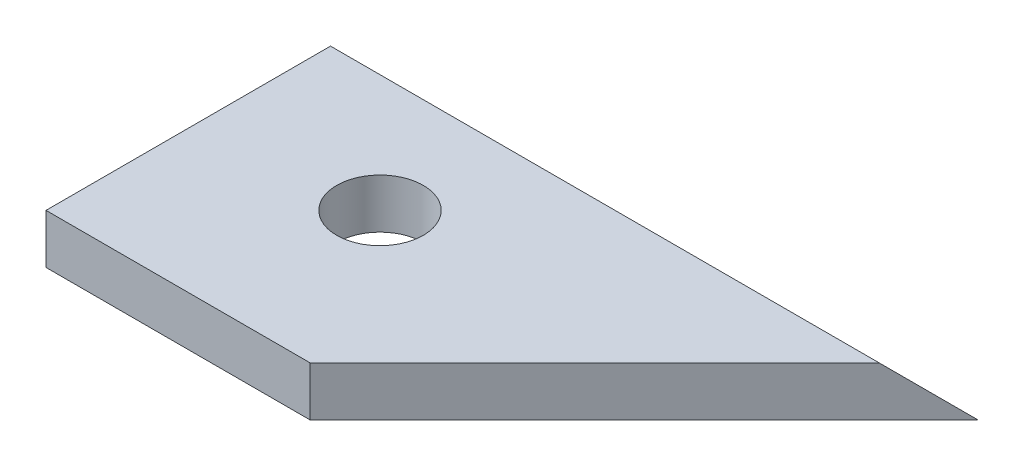
ISO-10303-21;
HEADER;
FILE_DESCRIPTION(('STEP AP214'),'2;1');
FILE_NAME('part.step','',(''),(''),'','','');
FILE_SCHEMA(('AUTOMOTIVE_DESIGN { 1 0 10303 214 1 1 1 1 }'));
ENDSEC;
DATA;
#1=APPLICATION_CONTEXT('core data for automotive mechanical design processes');
#2=APPLICATION_PROTOCOL_DEFINITION('international standard','automotive_design',2000,#1);
#3=PRODUCT_CONTEXT('',#1,'mechanical');
#4=PRODUCT('Part','Part','',(#3));
#5=PRODUCT_RELATED_PRODUCT_CATEGORY('part','',(#4));
#6=PRODUCT_DEFINITION_FORMATION('','',#4);
#7=PRODUCT_DEFINITION_CONTEXT('part definition',#1,'design');
#8=PRODUCT_DEFINITION('design','',#6,#7);
#9=PRODUCT_DEFINITION_SHAPE('','',#8);
#10=(LENGTH_UNIT() NAMED_UNIT(*) SI_UNIT(.MILLI.,.METRE.));
#11=(NAMED_UNIT(*) PLANE_ANGLE_UNIT() SI_UNIT($,.RADIAN.));
#12=(NAMED_UNIT(*) SI_UNIT($,.STERADIAN.) SOLID_ANGLE_UNIT());
#13=UNCERTAINTY_MEASURE_WITH_UNIT(LENGTH_MEASURE(1.E-05),#10,'distance_accuracy_value','');
#14=(GEOMETRIC_REPRESENTATION_CONTEXT(3) GLOBAL_UNCERTAINTY_ASSIGNED_CONTEXT((#13)) GLOBAL_UNIT_ASSIGNED_CONTEXT((#10,
#11,#12)) REPRESENTATION_CONTEXT('',''));
#15=CARTESIAN_POINT('',(0.,0.,0.));
#16=DIRECTION('',(0.,0.,1.));
#17=DIRECTION('',(1.,0.,0.));
#18=AXIS2_PLACEMENT_3D('',#15,#16,#17);
#19=CARTESIAN_POINT('',(0.,8.,0.));
#20=DIRECTION('',(0.,1.,0.));
#21=DIRECTION('',(0.,0.,1.));
#22=AXIS2_PLACEMENT_3D('',#19,#20,#21);
#23=PLANE('',#22);
#24=CARTESIAN_POINT('',(-15.6862915010152,8.,-5.28638497652583));
#25=DIRECTION('',(0.,1.,0.));
#26=DIRECTION('',(0.,0.,1.));
#27=AXIS2_PLACEMENT_3D('',#24,#25,#26);
#28=CIRCLE('',#27,7.);
#29=CARTESIAN_POINT('',(-15.6862915010152,8.,1.71361502347417));
#30=VERTEX_POINT('',#29);
#31=EDGE_CURVE('E102',#30,#30,#28,.T.);
#32=ORIENTED_EDGE('',*,*,#31,.F.);
#33=EDGE_LOOP('',(#32));
#34=FACE_BOUND('',#33,.T.);
#35=DIRECTION('',(0.707106781186546,0.,-0.707106781186549));
#36=VECTOR('',#35,1.);
#37=CARTESIAN_POINT('',(0.,8.,21.7136150234742));
#38=LINE('',#37,#36);
#39=CARTESIAN_POINT('',(0.,8.,21.7136150234742));
#40=VERTEX_POINT('',#39);
#41=CARTESIAN_POINT('',(45.9999999999998,8.,-24.2863849765257));
#42=VERTEX_POINT('',#41);
#43=EDGE_CURVE('E98',#40,#42,#38,.T.);
#44=ORIENTED_EDGE('',*,*,#43,.T.);
#45=DIRECTION('',(-1.,0.,0.));
#46=VECTOR('',#45,1.);
#47=CARTESIAN_POINT('',(149.313708498985,8.,-24.2863849765257));
#48=LINE('',#47,#46);
#49=CARTESIAN_POINT('',(-42.6862915010153,8.,-24.2863849765257));
#50=VERTEX_POINT('',#49);
#51=EDGE_CURVE('E78',#42,#50,#48,.T.);
#52=ORIENTED_EDGE('',*,*,#51,.T.);
#53=DIRECTION('',(0.,0.,1.));
#54=VECTOR('',#53,1.);
#55=CARTESIAN_POINT('',(-42.6862915010153,8.,-32.2863849765258));
#56=LINE('',#55,#54);
#57=CARTESIAN_POINT('',(-42.6862915010152,8.,21.7136150234742));
#58=VERTEX_POINT('',#57);
#59=EDGE_CURVE('E92',#50,#58,#56,.T.);
#60=ORIENTED_EDGE('',*,*,#59,.T.);
#61=DIRECTION('',(1.,0.,0.));
#62=VECTOR('',#61,1.);
#63=CARTESIAN_POINT('',(-42.6862915010152,8.,21.7136150234742));
#64=LINE('',#63,#62);
#65=EDGE_CURVE('E52',#58,#40,#64,.T.);
#66=ORIENTED_EDGE('',*,*,#65,.T.);
#67=EDGE_LOOP('',(#44,#52,#60,#66));
#68=FACE_BOUND('',#67,.T.);
#69=ADVANCED_FACE('F35',(#34,#68),#23,.T.);
#70=CARTESIAN_POINT('',(-42.6862915010153,8.,-32.2863849765258));
#71=DIRECTION('',(1.,0.,0.));
#72=DIRECTION('',(0.,0.,-1.));
#73=AXIS2_PLACEMENT_3D('',#70,#71,#72);
#74=PLANE('',#73);
#75=DIRECTION('',(0.,-0.707106781186544,-0.707106781186551));
#76=VECTOR('',#75,1.);
#77=CARTESIAN_POINT('',(-42.6862915010153,3.99999999999995,-28.2863849765258));
#78=LINE('',#77,#76);
#79=CARTESIAN_POINT('',(-42.6862915010153,0.,-32.2863849765258));
#80=VERTEX_POINT('',#79);
#81=EDGE_CURVE('E115',#50,#80,#78,.T.);
#82=ORIENTED_EDGE('',*,*,#81,.T.);
#83=DIRECTION('',(0.,0.,1.));
#84=VECTOR('',#83,1.);
#85=CARTESIAN_POINT('',(-42.6862915010153,0.,-32.2863849765258));
#86=LINE('',#85,#84);
#87=CARTESIAN_POINT('',(-42.6862915010152,0.,21.7136150234742));
#88=VERTEX_POINT('',#87);
#89=EDGE_CURVE('E91',#80,#88,#86,.T.);
#90=ORIENTED_EDGE('',*,*,#89,.T.);
#91=DIRECTION('',(0.,-1.,0.));
#92=VECTOR('',#91,1.);
#93=CARTESIAN_POINT('',(-42.6862915010152,8.,21.7136150234742));
#94=LINE('',#93,#92);
#95=EDGE_CURVE('E11',#58,#88,#94,.T.);
#96=ORIENTED_EDGE('',*,*,#95,.F.);
#97=ORIENTED_EDGE('',*,*,#59,.F.);
#98=EDGE_LOOP('',(#82,#90,#96,#97));
#99=FACE_BOUND('',#98,.T.);
#100=ADVANCED_FACE('F37',(#99),#74,.F.);
#101=CARTESIAN_POINT('',(0.,8.,21.7136150234742));
#102=DIRECTION('',(-0.707106781186549,0.,-0.707106781186546));
#103=DIRECTION('',(-0.707106781186546,0.,0.707106781186549));
#104=AXIS2_PLACEMENT_3D('',#101,#102,#103);
#105=PLANE('',#104);
#106=DIRECTION('',(0.577350269189626,-0.577350269189623,-0.577350269189629));
#107=VECTOR('',#106,1.);
#108=CARTESIAN_POINT('',(15.3333333333331,38.6666666666665,6.38028169014105));
#109=LINE('',#108,#107);
#110=CARTESIAN_POINT('',(53.9999999999998,0.,-32.2863849765258));
#111=VERTEX_POINT('',#110);
#112=EDGE_CURVE('E70',#42,#111,#109,.T.);
#113=ORIENTED_EDGE('',*,*,#112,.F.);
#114=ORIENTED_EDGE('',*,*,#43,.F.);
#115=DIRECTION('',(0.,-1.,0.));
#116=VECTOR('',#115,1.);
#117=CARTESIAN_POINT('',(0.,8.,21.7136150234742));
#118=LINE('',#117,#116);
#119=CARTESIAN_POINT('',(0.,0.,21.7136150234742));
#120=VERTEX_POINT('',#119);
#121=EDGE_CURVE('E44',#40,#120,#118,.T.);
#122=ORIENTED_EDGE('',*,*,#121,.T.);
#123=DIRECTION('',(0.707106781186546,0.,-0.707106781186549));
#124=VECTOR('',#123,1.);
#125=CARTESIAN_POINT('',(0.,0.,21.7136150234742));
#126=LINE('',#125,#124);
#127=EDGE_CURVE('E89',#120,#111,#126,.T.);
#128=ORIENTED_EDGE('',*,*,#127,.T.);
#129=EDGE_LOOP('',(#113,#114,#122,#128));
#130=FACE_BOUND('',#129,.T.);
#131=ADVANCED_FACE('F94',(#130),#105,.F.);
#132=CARTESIAN_POINT('',(0.,0.,0.));
#133=DIRECTION('',(0.,1.,0.));
#134=DIRECTION('',(0.,0.,1.));
#135=AXIS2_PLACEMENT_3D('',#132,#133,#134);
#136=PLANE('',#135);
#137=ORIENTED_EDGE('',*,*,#89,.F.);
#138=DIRECTION('',(-1.,0.,0.));
#139=VECTOR('',#138,1.);
#140=CARTESIAN_POINT('',(-42.6862915010153,0.,-32.2863849765258));
#141=LINE('',#140,#139);
#142=EDGE_CURVE('E75',#111,#80,#141,.T.);
#143=ORIENTED_EDGE('',*,*,#142,.F.);
#144=ORIENTED_EDGE('',*,*,#127,.F.);
#145=DIRECTION('',(1.,0.,0.));
#146=VECTOR('',#145,1.);
#147=CARTESIAN_POINT('',(-42.6862915010152,0.,21.7136150234742));
#148=LINE('',#147,#146);
#149=EDGE_CURVE('E63',#88,#120,#148,.T.);
#150=ORIENTED_EDGE('',*,*,#149,.F.);
#151=EDGE_LOOP('',(#137,#143,#144,#150));
#152=FACE_BOUND('',#151,.T.);
#153=CARTESIAN_POINT('',(-15.6862915010152,0.,-5.28638497652583));
#154=DIRECTION('',(0.,1.,0.));
#155=DIRECTION('',(0.,0.,1.));
#156=AXIS2_PLACEMENT_3D('',#153,#154,#155);
#157=CIRCLE('',#156,7.);
#158=CARTESIAN_POINT('',(-15.6862915010152,0.,1.71361502347417));
#159=VERTEX_POINT('',#158);
#160=EDGE_CURVE('E82',#159,#159,#157,.T.);
#161=ORIENTED_EDGE('',*,*,#160,.T.);
#162=EDGE_LOOP('',(#161));
#163=FACE_BOUND('',#162,.T.);
#164=ADVANCED_FACE('F87',(#152,#163),#136,.F.);
#165=CARTESIAN_POINT('',(-42.6862915010152,8.,21.7136150234742));
#166=DIRECTION('',(0.,0.,-1.));
#167=DIRECTION('',(-1.,0.,0.));
#168=AXIS2_PLACEMENT_3D('',#165,#166,#167);
#169=PLANE('',#168);
#170=ORIENTED_EDGE('',*,*,#149,.T.);
#171=ORIENTED_EDGE('',*,*,#121,.F.);
#172=ORIENTED_EDGE('',*,*,#65,.F.);
#173=ORIENTED_EDGE('',*,*,#95,.T.);
#174=EDGE_LOOP('',(#170,#171,#172,#173));
#175=FACE_BOUND('',#174,.T.);
#176=ADVANCED_FACE('F114',(#175),#169,.F.);
#177=CARTESIAN_POINT('',(-15.6862915010152,8.,-5.28638497652583));
#178=DIRECTION('',(0.,-1.,0.));
#179=DIRECTION('',(0.,0.,-1.));
#180=AXIS2_PLACEMENT_3D('',#177,#178,#179);
#181=CYLINDRICAL_SURFACE('',#180,7.);
#182=ORIENTED_EDGE('',*,*,#31,.T.);
#183=EDGE_LOOP('',(#182));
#184=FACE_BOUND('',#183,.T.);
#185=ORIENTED_EDGE('',*,*,#160,.F.);
#186=EDGE_LOOP('',(#185));
#187=FACE_BOUND('',#186,.T.);
#188=ADVANCED_FACE('F128',(#184,#187),#181,.F.);
#189=CARTESIAN_POINT('',(149.313708498985,3.99999999999995,-28.2863849765258));
#190=DIRECTION('',(0.,0.707106781186551,-0.707106781186544));
#191=DIRECTION('',(0.,0.707106781186544,0.707106781186551));
#192=AXIS2_PLACEMENT_3D('',#189,#190,#191);
#193=PLANE('',#192);
#194=ORIENTED_EDGE('',*,*,#112,.T.);
#195=ORIENTED_EDGE('',*,*,#142,.T.);
#196=ORIENTED_EDGE('',*,*,#81,.F.);
#197=ORIENTED_EDGE('',*,*,#51,.F.);
#198=EDGE_LOOP('',(#194,#195,#196,#197));
#199=FACE_BOUND('',#198,.T.);
#200=ADVANCED_FACE('F72',(#199),#193,.T.);
#201=CLOSED_SHELL('',(#69,#100,#131,#164,#176,#188,#200));
#202=MANIFOLD_SOLID_BREP('B2',#201);
#203=ADVANCED_BREP_SHAPE_REPRESENTATION('',(#18,#202),#14);
#204=SHAPE_DEFINITION_REPRESENTATION(#9,#203);
ENDSEC;
END-ISO-10303-21;
